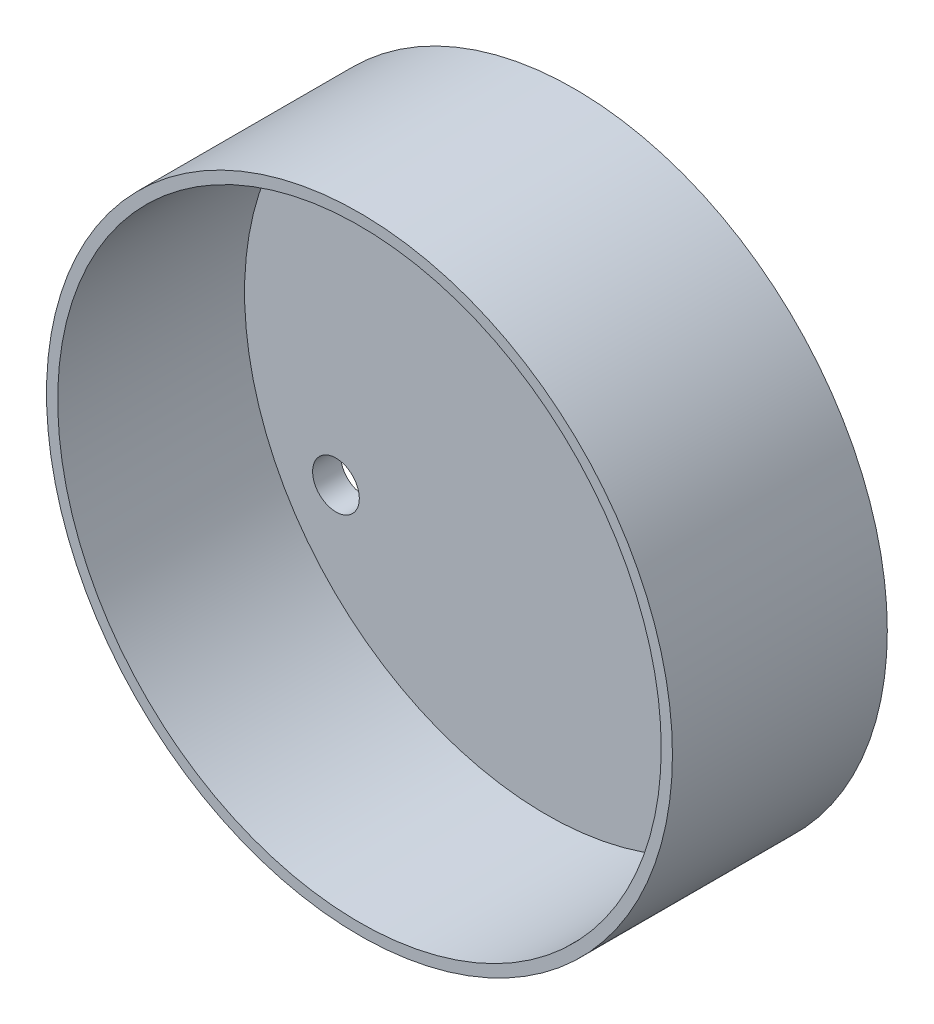
ISO-10303-21;
HEADER;
FILE_DESCRIPTION(('STEP AP214'),'2;1');
FILE_NAME('part.step','',(''),(''),'','','');
FILE_SCHEMA(('AUTOMOTIVE_DESIGN { 1 0 10303 214 1 1 1 1 }'));
ENDSEC;
DATA;
#1=APPLICATION_CONTEXT('core data for automotive mechanical design processes');
#2=APPLICATION_PROTOCOL_DEFINITION('international standard','automotive_design',2000,#1);
#3=PRODUCT_CONTEXT('',#1,'mechanical');
#4=PRODUCT('Part','Part','',(#3));
#5=PRODUCT_RELATED_PRODUCT_CATEGORY('part','',(#4));
#6=PRODUCT_DEFINITION_FORMATION('','',#4);
#7=PRODUCT_DEFINITION_CONTEXT('part definition',#1,'design');
#8=PRODUCT_DEFINITION('design','',#6,#7);
#9=PRODUCT_DEFINITION_SHAPE('','',#8);
#10=(LENGTH_UNIT() NAMED_UNIT(*) SI_UNIT(.MILLI.,.METRE.));
#11=(NAMED_UNIT(*) PLANE_ANGLE_UNIT() SI_UNIT($,.RADIAN.));
#12=(NAMED_UNIT(*) SI_UNIT($,.STERADIAN.) SOLID_ANGLE_UNIT());
#13=UNCERTAINTY_MEASURE_WITH_UNIT(LENGTH_MEASURE(1.E-05),#10,'distance_accuracy_value','');
#14=(GEOMETRIC_REPRESENTATION_CONTEXT(3) GLOBAL_UNCERTAINTY_ASSIGNED_CONTEXT((#13)) GLOBAL_UNIT_ASSIGNED_CONTEXT((#10,
#11,#12)) REPRESENTATION_CONTEXT('',''));
#15=CARTESIAN_POINT('',(0.,0.,0.));
#16=DIRECTION('',(0.,0.,1.));
#17=DIRECTION('',(1.,0.,0.));
#18=AXIS2_PLACEMENT_3D('',#15,#16,#17);
#19=CARTESIAN_POINT('',(0.,0.,1.5));
#20=DIRECTION('',(0.,0.,1.));
#21=DIRECTION('',(1.,0.,0.));
#22=AXIS2_PLACEMENT_3D('',#19,#20,#21);
#23=PLANE('',#22);
#24=CARTESIAN_POINT('',(-11.2583302491969,-6.50000000000048,1.5));
#25=DIRECTION('',(0.,0.,1.));
#26=DIRECTION('',(1.,0.,0.));
#27=AXIS2_PLACEMENT_3D('',#24,#25,#26);
#28=CIRCLE('',#27,1.25000000000105);
#29=CARTESIAN_POINT('',(-10.0083302491958,-6.50000000000048,1.5));
#30=VERTEX_POINT('',#29);
#31=EDGE_CURVE('E57',#30,#30,#28,.T.);
#32=ORIENTED_EDGE('',*,*,#31,.F.);
#33=EDGE_LOOP('',(#32));
#34=FACE_BOUND('',#33,.T.);
#35=CARTESIAN_POINT('',(0.,13.,1.5));
#36=DIRECTION('',(0.,0.,1.));
#37=DIRECTION('',(1.,0.,0.));
#38=AXIS2_PLACEMENT_3D('',#35,#36,#37);
#39=CIRCLE('',#38,1.25);
#40=CARTESIAN_POINT('',(1.25,13.,1.5));
#41=VERTEX_POINT('',#40);
#42=EDGE_CURVE('E44',#41,#41,#39,.T.);
#43=ORIENTED_EDGE('',*,*,#42,.F.);
#44=EDGE_LOOP('',(#43));
#45=FACE_BOUND('',#44,.T.);
#46=CARTESIAN_POINT('',(11.2583302491985,-6.49999999999952,1.5));
#47=DIRECTION('',(0.,0.,1.));
#48=DIRECTION('',(1.,0.,0.));
#49=AXIS2_PLACEMENT_3D('',#46,#47,#48);
#50=CIRCLE('',#49,1.25000000000071);
#51=CARTESIAN_POINT('',(12.5083302491992,-6.49999999999952,1.5));
#52=VERTEX_POINT('',#51);
#53=EDGE_CURVE('E52',#52,#52,#50,.T.);
#54=ORIENTED_EDGE('',*,*,#53,.F.);
#55=EDGE_LOOP('',(#54));
#56=FACE_BOUND('',#55,.T.);
#57=CARTESIAN_POINT('',(0.,0.,1.5));
#58=DIRECTION('',(0.,0.,1.));
#59=DIRECTION('',(1.,0.,0.));
#60=AXIS2_PLACEMENT_3D('',#57,#58,#59);
#61=CIRCLE('',#60,16.15);
#62=CARTESIAN_POINT('',(16.15,0.,1.5));
#63=VERTEX_POINT('',#62);
#64=EDGE_CURVE('E10',#63,#63,#61,.F.);
#65=ORIENTED_EDGE('',*,*,#64,.F.);
#66=EDGE_LOOP('',(#65));
#67=FACE_BOUND('',#66,.T.);
#68=ADVANCED_FACE('F33',(#34,#45,#56,#67),#23,.T.);
#69=CARTESIAN_POINT('',(0.,0.,0.));
#70=DIRECTION('',(0.,0.,1.));
#71=DIRECTION('',(1.,0.,0.));
#72=AXIS2_PLACEMENT_3D('',#69,#70,#71);
#73=PLANE('',#72);
#74=CARTESIAN_POINT('',(0.,0.,0.));
#75=DIRECTION('',(0.,0.,1.));
#76=DIRECTION('',(1.,0.,0.));
#77=AXIS2_PLACEMENT_3D('',#74,#75,#76);
#78=CIRCLE('',#77,16.75);
#79=CARTESIAN_POINT('',(16.75,0.,0.));
#80=VERTEX_POINT('',#79);
#81=EDGE_CURVE('E40',#80,#80,#78,.T.);
#82=ORIENTED_EDGE('',*,*,#81,.F.);
#83=EDGE_LOOP('',(#82));
#84=FACE_BOUND('',#83,.T.);
#85=CARTESIAN_POINT('',(0.,13.,0.));
#86=DIRECTION('',(0.,0.,1.));
#87=DIRECTION('',(1.,0.,0.));
#88=AXIS2_PLACEMENT_3D('',#85,#86,#87);
#89=CIRCLE('',#88,1.25);
#90=CARTESIAN_POINT('',(1.25,13.,0.));
#91=VERTEX_POINT('',#90);
#92=EDGE_CURVE('E48',#91,#91,#89,.T.);
#93=ORIENTED_EDGE('',*,*,#92,.T.);
#94=EDGE_LOOP('',(#93));
#95=FACE_BOUND('',#94,.T.);
#96=CARTESIAN_POINT('',(11.2583302491985,-6.49999999999952,0.));
#97=DIRECTION('',(0.,0.,1.));
#98=DIRECTION('',(1.,0.,0.));
#99=AXIS2_PLACEMENT_3D('',#96,#97,#98);
#100=CIRCLE('',#99,1.25000000000071);
#101=CARTESIAN_POINT('',(12.5083302491992,-6.49999999999952,0.));
#102=VERTEX_POINT('',#101);
#103=EDGE_CURVE('E54',#102,#102,#100,.T.);
#104=ORIENTED_EDGE('',*,*,#103,.T.);
#105=EDGE_LOOP('',(#104));
#106=FACE_BOUND('',#105,.T.);
#107=CARTESIAN_POINT('',(-11.2583302491969,-6.50000000000048,0.));
#108=DIRECTION('',(0.,0.,1.));
#109=DIRECTION('',(1.,0.,0.));
#110=AXIS2_PLACEMENT_3D('',#107,#108,#109);
#111=CIRCLE('',#110,1.25000000000105);
#112=CARTESIAN_POINT('',(-10.0083302491958,-6.50000000000048,0.));
#113=VERTEX_POINT('',#112);
#114=EDGE_CURVE('E60',#113,#113,#111,.T.);
#115=ORIENTED_EDGE('',*,*,#114,.T.);
#116=EDGE_LOOP('',(#115));
#117=FACE_BOUND('',#116,.T.);
#118=ADVANCED_FACE('F89',(#84,#95,#106,#117),#73,.F.);
#119=CARTESIAN_POINT('',(0.,0.,1.5));
#120=DIRECTION('',(0.,0.,-1.));
#121=DIRECTION('',(-1.,0.,0.));
#122=AXIS2_PLACEMENT_3D('',#119,#120,#121);
#123=CYLINDRICAL_SURFACE('',#122,16.75);
#124=ORIENTED_EDGE('',*,*,#81,.T.);
#125=EDGE_LOOP('',(#124));
#126=FACE_BOUND('',#125,.T.);
#127=CARTESIAN_POINT('',(0.,0.,11.5));
#128=DIRECTION('',(0.,0.,1.));
#129=DIRECTION('',(1.,0.,0.));
#130=AXIS2_PLACEMENT_3D('',#127,#128,#129);
#131=CIRCLE('',#130,16.75);
#132=CARTESIAN_POINT('',(16.75,0.,11.5));
#133=VERTEX_POINT('',#132);
#134=EDGE_CURVE('E63',#133,#133,#131,.T.);
#135=ORIENTED_EDGE('',*,*,#134,.F.);
#136=EDGE_LOOP('',(#135));
#137=FACE_BOUND('',#136,.T.);
#138=ADVANCED_FACE('F35',(#126,#137),#123,.T.);
#139=CARTESIAN_POINT('',(0.,13.,1.5));
#140=DIRECTION('',(0.,0.,-1.));
#141=DIRECTION('',(-1.,0.,0.));
#142=AXIS2_PLACEMENT_3D('',#139,#140,#141);
#143=CYLINDRICAL_SURFACE('',#142,1.25);
#144=ORIENTED_EDGE('',*,*,#42,.T.);
#145=EDGE_LOOP('',(#144));
#146=FACE_BOUND('',#145,.T.);
#147=ORIENTED_EDGE('',*,*,#92,.F.);
#148=EDGE_LOOP('',(#147));
#149=FACE_BOUND('',#148,.T.);
#150=ADVANCED_FACE('F101',(#146,#149),#143,.F.);
#151=CARTESIAN_POINT('',(11.2583302491985,-6.49999999999952,1.5));
#152=DIRECTION('',(0.,0.,-1.));
#153=DIRECTION('',(-1.,0.,0.));
#154=AXIS2_PLACEMENT_3D('',#151,#152,#153);
#155=CYLINDRICAL_SURFACE('',#154,1.25000000000071);
#156=ORIENTED_EDGE('',*,*,#53,.T.);
#157=EDGE_LOOP('',(#156));
#158=FACE_BOUND('',#157,.T.);
#159=ORIENTED_EDGE('',*,*,#103,.F.);
#160=EDGE_LOOP('',(#159));
#161=FACE_BOUND('',#160,.T.);
#162=ADVANCED_FACE('F85',(#158,#161),#155,.F.);
#163=CARTESIAN_POINT('',(-11.2583302491969,-6.50000000000048,1.5));
#164=DIRECTION('',(0.,0.,-1.));
#165=DIRECTION('',(-1.,0.,0.));
#166=AXIS2_PLACEMENT_3D('',#163,#164,#165);
#167=CYLINDRICAL_SURFACE('',#166,1.25000000000105);
#168=ORIENTED_EDGE('',*,*,#31,.T.);
#169=EDGE_LOOP('',(#168));
#170=FACE_BOUND('',#169,.T.);
#171=ORIENTED_EDGE('',*,*,#114,.F.);
#172=EDGE_LOOP('',(#171));
#173=FACE_BOUND('',#172,.T.);
#174=ADVANCED_FACE('F76',(#170,#173),#167,.F.);
#175=CARTESIAN_POINT('',(0.,0.,11.5));
#176=DIRECTION('',(0.,0.,1.));
#177=DIRECTION('',(1.,0.,0.));
#178=AXIS2_PLACEMENT_3D('',#175,#176,#177);
#179=PLANE('',#178);
#180=ORIENTED_EDGE('',*,*,#134,.T.);
#181=EDGE_LOOP('',(#180));
#182=FACE_BOUND('',#181,.T.);
#183=CARTESIAN_POINT('',(0.,0.,11.5));
#184=DIRECTION('',(0.,0.,1.));
#185=DIRECTION('',(1.,0.,0.));
#186=AXIS2_PLACEMENT_3D('',#183,#184,#185);
#187=CIRCLE('',#186,16.15);
#188=CARTESIAN_POINT('',(16.15,0.,11.5));
#189=VERTEX_POINT('',#188);
#190=EDGE_CURVE('E68',#189,#189,#187,.T.);
#191=ORIENTED_EDGE('',*,*,#190,.F.);
#192=EDGE_LOOP('',(#191));
#193=FACE_BOUND('',#192,.T.);
#194=ADVANCED_FACE('F74',(#182,#193),#179,.T.);
#195=CARTESIAN_POINT('',(0.,0.,11.5));
#196=DIRECTION('',(0.,0.,-1.));
#197=DIRECTION('',(-1.,0.,0.));
#198=AXIS2_PLACEMENT_3D('',#195,#196,#197);
#199=CYLINDRICAL_SURFACE('',#198,16.15);
#200=ORIENTED_EDGE('',*,*,#190,.T.);
#201=EDGE_LOOP('',(#200));
#202=FACE_BOUND('',#201,.T.);
#203=ORIENTED_EDGE('',*,*,#64,.T.);
#204=EDGE_LOOP('',(#203));
#205=FACE_BOUND('',#204,.T.);
#206=ADVANCED_FACE('F72',(#202,#205),#199,.F.);
#207=CLOSED_SHELL('',(#68,#118,#138,#150,#162,#174,#194,#206));
#208=MANIFOLD_SOLID_BREP('B2',#207);
#209=ADVANCED_BREP_SHAPE_REPRESENTATION('',(#18,#208),#14);
#210=SHAPE_DEFINITION_REPRESENTATION(#9,#209);
ENDSEC;
END-ISO-10303-21;
